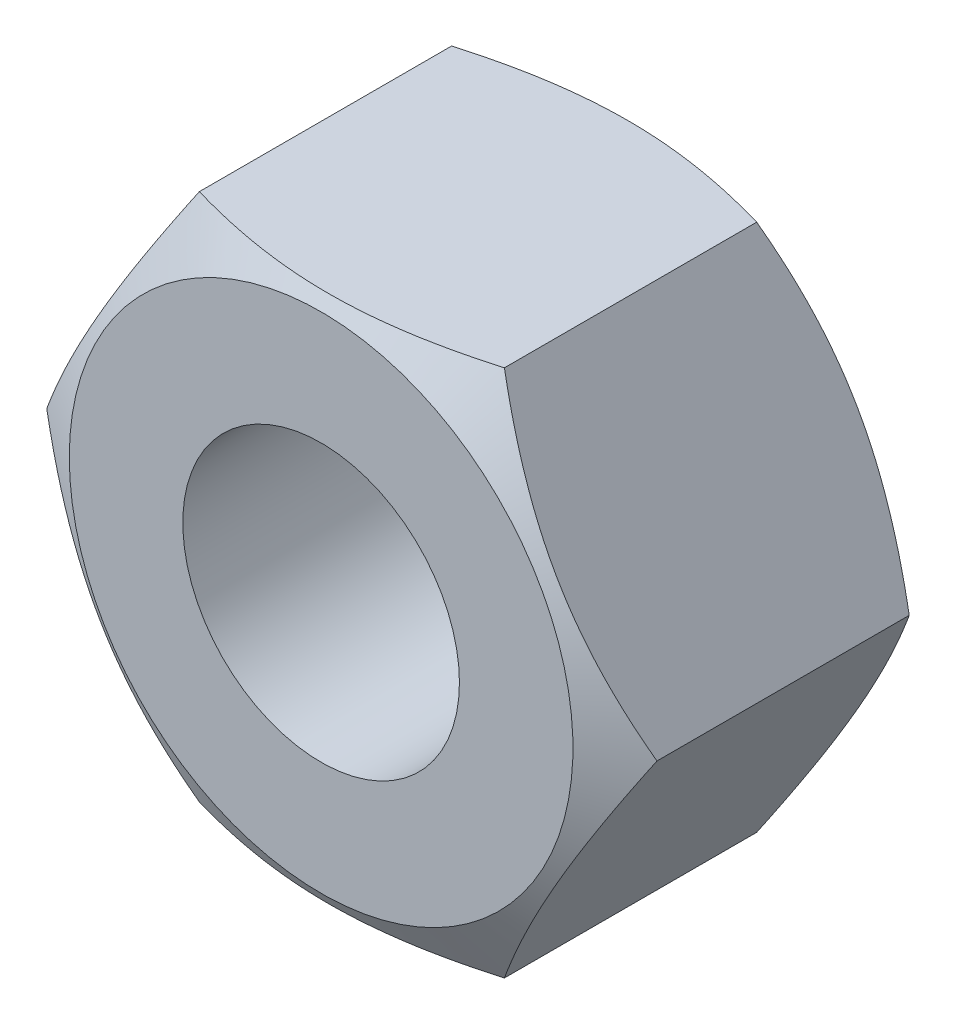
ISO-10303-21;
HEADER;
FILE_DESCRIPTION(('STEP AP214'),'2;1');
FILE_NAME('part.step','',(''),(''),'','','');
FILE_SCHEMA(('AUTOMOTIVE_DESIGN { 1 0 10303 214 1 1 1 1 }'));
ENDSEC;
DATA;
#1=APPLICATION_CONTEXT('core data for automotive mechanical design processes');
#2=APPLICATION_PROTOCOL_DEFINITION('international standard','automotive_design',2000,#1);
#3=PRODUCT_CONTEXT('',#1,'mechanical');
#4=PRODUCT('Part','Part','',(#3));
#5=PRODUCT_RELATED_PRODUCT_CATEGORY('part','',(#4));
#6=PRODUCT_DEFINITION_FORMATION('','',#4);
#7=PRODUCT_DEFINITION_CONTEXT('part definition',#1,'design');
#8=PRODUCT_DEFINITION('design','',#6,#7);
#9=PRODUCT_DEFINITION_SHAPE('','',#8);
#10=(LENGTH_UNIT() NAMED_UNIT(*) SI_UNIT(.MILLI.,.METRE.));
#11=(NAMED_UNIT(*) PLANE_ANGLE_UNIT() SI_UNIT($,.RADIAN.));
#12=(NAMED_UNIT(*) SI_UNIT($,.STERADIAN.) SOLID_ANGLE_UNIT());
#13=UNCERTAINTY_MEASURE_WITH_UNIT(LENGTH_MEASURE(1.E-05),#10,'distance_accuracy_value','');
#14=(GEOMETRIC_REPRESENTATION_CONTEXT(3) GLOBAL_UNCERTAINTY_ASSIGNED_CONTEXT((#13)) GLOBAL_UNIT_ASSIGNED_CONTEXT((#10,
#11,#12)) REPRESENTATION_CONTEXT('',''));
#15=CARTESIAN_POINT('',(0.,0.,0.));
#16=DIRECTION('',(0.,0.,1.));
#17=DIRECTION('',(1.,0.,0.));
#18=AXIS2_PLACEMENT_3D('',#15,#16,#17);
#19=CARTESIAN_POINT('',(-4.618802153517,-8.,-9.5));
#20=DIRECTION('',(0.,-1.,0.));
#21=DIRECTION('',(0.,0.,-1.));
#22=AXIS2_PLACEMENT_3D('',#19,#20,#21);
#23=PLANE('',#22);
#24=CARTESIAN_POINT('',(-12.2197397608942,-8.,-4.03022141401348));
#25=CARTESIAN_POINT('',(-11.868727077628,-8.,-3.86071753558878));
#26=CARTESIAN_POINT('',(-11.5168810873258,-8.,-3.69290788715775));
#27=CARTESIAN_POINT('',(-10.811071762805,-8.,-3.36164590509763));
#28=CARTESIAN_POINT('',(-10.4571080716728,-8.,-3.19819433283699));
#29=CARTESIAN_POINT('',(-9.74468564067489,-8.,-2.87574971001535));
#30=CARTESIAN_POINT('',(-9.38621274986467,-8.,-2.71678781133591));
#31=CARTESIAN_POINT('',(-8.66630957591125,-8.,-2.40573517247906));
#32=CARTESIAN_POINT('',(-8.30487944908738,-8.,-2.25364407184791));
#33=CARTESIAN_POINT('',(-7.57413978369761,-8.,-1.95641301534528));
#34=CARTESIAN_POINT('',(-7.20478765345143,-8.,-1.81137718620378));
#35=CARTESIAN_POINT('',(-6.46171720997474,-8.,-1.53273971576201));
#36=CARTESIAN_POINT('',(-6.08799841532019,-8.,-1.39913934899933));
#37=CARTESIAN_POINT('',(-5.33637311349062,-8.,-1.14698509208066));
#38=CARTESIAN_POINT('',(-4.95847754661189,-8.,-1.02839894848666));
#39=CARTESIAN_POINT('',(-4.19732915983582,-8.,-0.810141761328374));
#40=CARTESIAN_POINT('',(-3.81407808273628,-8.,-0.710464711465893));
#41=CARTESIAN_POINT('',(-3.04188080794891,-8.,-0.534888500997528));
#42=CARTESIAN_POINT('',(-2.65293275749492,-8.,-0.45899726417533));
#43=CARTESIAN_POINT('',(-2.06611409311266,-8.,-0.366816970191737));
#44=CARTESIAN_POINT('',(-1.86991776010488,-8.,-0.339697656224122));
#45=CARTESIAN_POINT('',(-1.47661497416927,-8.,-0.293211843890533));
#46=CARTESIAN_POINT('',(-1.27950860909836,-8.,-0.273844612319937));
#47=CARTESIAN_POINT('',(-0.885886145124463,-8.,-0.243382864344022));
#48=CARTESIAN_POINT('',(-0.689373978742672,-8.,-0.232237734902545));
#49=CARTESIAN_POINT('',(-0.296054597973732,-8.,-0.218278609617564));
#50=CARTESIAN_POINT('',(-0.0992473880544099,-8.,-0.215464488867905));
#51=CARTESIAN_POINT('',(0.294253985501273,-8.,-0.218234288376122));
#52=CARTESIAN_POINT('',(0.490948165353505,-8.,-0.223815876360531));
#53=CARTESIAN_POINT('',(0.883931015832238,-8.,-0.243239131701583));
#54=CARTESIAN_POINT('',(1.08021966403537,-8.,-0.257081244163129));
#55=CARTESIAN_POINT('',(1.55678522848848,-8.,-0.300428868747637));
#56=CARTESIAN_POINT('',(1.83668887397854,-8.,-0.334118737053714));
#57=CARTESIAN_POINT('',(2.39428319697744,-8.,-0.416412622983888));
#58=CARTESIAN_POINT('',(2.67197353587608,-8.,-0.465018879354708));
#59=CARTESIAN_POINT('',(3.50221902369727,-8.,-0.630772157411167));
#60=CARTESIAN_POINT('',(4.05086138070487,-8.,-0.767742256526613));
#61=CARTESIAN_POINT('',(4.87147978211415,-8.,-1.0036664068753));
#62=CARTESIAN_POINT('',(5.14774973161582,-8.,-1.08853026186987));
#63=CARTESIAN_POINT('',(5.69762075848945,-8.,-1.26665801536022));
#64=CARTESIAN_POINT('',(5.9712215938885,-8.,-1.35992266774338));
#65=CARTESIAN_POINT('',(6.51438825331977,-8.,-1.55285819829678));
#66=CARTESIAN_POINT('',(6.7839681451146,-8.,-1.65248987260587));
#67=CARTESIAN_POINT('',(7.32083790463607,-8.,-1.85748379288001));
#68=CARTESIAN_POINT('',(7.58812853108144,-8.,-1.96284404787963));
#69=CARTESIAN_POINT('',(7.85445593980949,-8.,-2.07053145477725));
#70=B_SPLINE_CURVE_WITH_KNOTS('',3,(#24,#25,#26,#27,#28,#29,#30,#31,#32,#33,#34,#35,#36,#37,#38,
#39,#40,#41,#42,#43,#44,#45,#46,#47,#48,#49,#50,#51,#52,#53,#54,#55,#56,#57,#58,#59,#60,#61,#62,
#63,#64,#65,#66,#67,#68,#69),.UNSPECIFIED.,.F.,.F.,(4,2,2,2,2,2,2,2,2,2,2,2,2,2,2,2,2,2,2,2,2,2,
4),(0.,1.16940595501898,2.33901488747737,3.51536959390645,4.69166251493113,5.8819389073909,
7.07234778963652,8.26015441647358,9.44758311348243,10.6354069599858,11.2294630710583,
11.8234629820487,12.4137751626826,13.0040784927678,13.5942178706959,14.1843890501945,
15.0296797373486,15.8750973532219,17.5691968968821,18.4361612735178,19.3032035291794,
20.1653433416826,21.0271854097738),.UNSPECIFIED.);
#71=CARTESIAN_POINT('',(-4.618802153517,-8.,-0.931037530762424));
#72=VERTEX_POINT('',#71);
#73=CARTESIAN_POINT('',(4.61880215351701,-8.,-0.931037530762424));
#74=VERTEX_POINT('',#73);
#75=EDGE_CURVE('E52',#72,#74,#70,.T.);
#76=ORIENTED_EDGE('',*,*,#75,.F.);
#77=DIRECTION('',(0.,0.,1.));
#78=VECTOR('',#77,1.);
#79=CARTESIAN_POINT('',(-4.618802153517,-8.,-9.5));
#80=LINE('',#79,#78);
#81=CARTESIAN_POINT('',(-4.618802153517,-8.,-8.56896246923758));
#82=VERTEX_POINT('',#81);
#83=EDGE_CURVE('E11',#82,#72,#80,.T.);
#84=ORIENTED_EDGE('',*,*,#83,.F.);
#85=CARTESIAN_POINT('',(-12.2197397608942,-8.,-5.46977858598652));
#86=CARTESIAN_POINT('',(-11.868727077628,-8.,-5.63928246441121));
#87=CARTESIAN_POINT('',(-11.5168810873258,-8.,-5.80709211284225));
#88=CARTESIAN_POINT('',(-10.811071762805,-8.,-6.13835409490237));
#89=CARTESIAN_POINT('',(-10.4571080716728,-8.,-6.30180566716301));
#90=CARTESIAN_POINT('',(-9.74468564067489,-8.,-6.62425028998465));
#91=CARTESIAN_POINT('',(-9.38621274986466,-8.,-6.78321218866409));
#92=CARTESIAN_POINT('',(-8.66630957591124,-8.,-7.09426482752095));
#93=CARTESIAN_POINT('',(-8.30487944908737,-8.,-7.2463559281521));
#94=CARTESIAN_POINT('',(-7.5741397836976,-8.,-7.54358698465473));
#95=CARTESIAN_POINT('',(-7.20478765345143,-8.,-7.68862281379622));
#96=CARTESIAN_POINT('',(-6.46171720997473,-8.,-7.96726028423799));
#97=CARTESIAN_POINT('',(-6.08799841532019,-8.,-8.10086065100067));
#98=CARTESIAN_POINT('',(-5.33637311349061,-8.,-8.35301490791934));
#99=CARTESIAN_POINT('',(-4.95847754661189,-8.,-8.47160105151334));
#100=CARTESIAN_POINT('',(-4.19732915983582,-8.,-8.68985823867163));
#101=CARTESIAN_POINT('',(-3.81407808273628,-8.,-8.78953528853411));
#102=CARTESIAN_POINT('',(-3.04188080794891,-8.,-8.96511149900247));
#103=CARTESIAN_POINT('',(-2.65293275749492,-8.,-9.04100273582467));
#104=CARTESIAN_POINT('',(-2.06611409311266,-8.,-9.13318302980826));
#105=CARTESIAN_POINT('',(-1.86991776010488,-8.,-9.16030234377588));
#106=CARTESIAN_POINT('',(-1.47661497416927,-8.,-9.20678815610946));
#107=CARTESIAN_POINT('',(-1.27950860909837,-8.,-9.22615538768006));
#108=CARTESIAN_POINT('',(-0.885886145124465,-8.,-9.25661713565598));
#109=CARTESIAN_POINT('',(-0.689373978742674,-8.,-9.26776226509745));
#110=CARTESIAN_POINT('',(-0.296054597973734,-8.,-9.28172139038243));
#111=CARTESIAN_POINT('',(-0.0992473880544113,-8.,-9.28453551113209));
#112=CARTESIAN_POINT('',(0.294253985501272,-8.,-9.28176571162388));
#113=CARTESIAN_POINT('',(0.490948165353505,-8.,-9.27618412363947));
#114=CARTESIAN_POINT('',(0.883931015832238,-8.,-9.25676086829842));
#115=CARTESIAN_POINT('',(1.08021966403537,-8.,-9.24291875583687));
#116=CARTESIAN_POINT('',(1.55678522848848,-8.,-9.19957113125236));
#117=CARTESIAN_POINT('',(1.83668887397854,-8.,-9.16588126294629));
#118=CARTESIAN_POINT('',(2.39428319697744,-8.,-9.08358737701611));
#119=CARTESIAN_POINT('',(2.67197353587608,-8.,-9.03498112064529));
#120=CARTESIAN_POINT('',(3.50221902369727,-8.,-8.86922784258883));
#121=CARTESIAN_POINT('',(4.05086138070487,-8.,-8.73225774347338));
#122=CARTESIAN_POINT('',(4.87147978211415,-8.,-8.4963335931247));
#123=CARTESIAN_POINT('',(5.14774973161582,-8.,-8.41146973813013));
#124=CARTESIAN_POINT('',(5.69762075848945,-8.,-8.23334198463978));
#125=CARTESIAN_POINT('',(5.97122159388849,-8.,-8.14007733225662));
#126=CARTESIAN_POINT('',(6.51438825331976,-8.,-7.94714180170322));
#127=CARTESIAN_POINT('',(6.78396814511459,-8.,-7.84751012739413));
#128=CARTESIAN_POINT('',(7.32083790463606,-8.,-7.64251620711999));
#129=CARTESIAN_POINT('',(7.58812853108143,-8.,-7.53715595212037));
#130=CARTESIAN_POINT('',(7.85445593980948,-8.,-7.42946854522275));
#131=B_SPLINE_CURVE_WITH_KNOTS('',3,(#85,#86,#87,#88,#89,#90,#91,#92,#93,#94,#95,#96,#97,#98,
#99,#100,#101,#102,#103,#104,#105,#106,#107,#108,#109,#110,#111,#112,#113,#114,#115,#116,#117,
#118,#119,#120,#121,#122,#123,#124,#125,#126,#127,#128,#129,#130),.UNSPECIFIED.,.F.,.F.,(4,2,2,
2,2,2,2,2,2,2,2,2,2,2,2,2,2,2,2,2,2,2,4),(0.,1.16940595501898,2.33901488747738,3.51536959390645,
4.69166251493114,5.8819389073909,7.07234778963652,8.26015441647358,9.44758311348242,
10.6354069599858,11.2294630710583,11.8234629820487,12.4137751626826,13.0040784927678,
13.5942178706959,14.1843890501945,15.0296797373486,15.8750973532219,17.5691968968821,
18.4361612735178,19.3032035291794,20.1653433416826,21.0271854097738),.UNSPECIFIED.);
#132=CARTESIAN_POINT('',(4.618802153517,-8.,-8.56896246923758));
#133=VERTEX_POINT('',#132);
#134=EDGE_CURVE('E131',#133,#82,#131,.F.);
#135=ORIENTED_EDGE('',*,*,#134,.F.);
#136=DIRECTION('',(0.,0.,1.));
#137=VECTOR('',#136,1.);
#138=CARTESIAN_POINT('',(4.61880215351701,-8.,-9.5));
#139=LINE('',#138,#137);
#140=EDGE_CURVE('E39',#133,#74,#139,.T.);
#141=ORIENTED_EDGE('',*,*,#140,.T.);
#142=EDGE_LOOP('',(#76,#84,#135,#141));
#143=FACE_BOUND('',#142,.T.);
#144=ADVANCED_FACE('F35',(#143),#23,.T.);
#145=CARTESIAN_POINT('',(-9.23760430703401,0.,-9.5));
#146=DIRECTION('',(-0.866025403784438,-0.5,0.));
#147=DIRECTION('',(0.5,-0.866025403784439,0.));
#148=AXIS2_PLACEMENT_3D('',#145,#146,#147);
#149=PLANE('',#148);
#150=CARTESIAN_POINT('',(-9.23771977708785,0.00020000000000001,-0.931104198679076));
#151=CARTESIAN_POINT('',(-9.13619343437813,-0.175648783879896,-0.872497064993401));
#152=CARTESIAN_POINT('',(-9.03428856550538,-0.352153194306134,-0.816549751993393));
#153=CARTESIAN_POINT('',(-8.82965122633296,-0.706595462878459,-0.71070735597077));
#154=CARTESIAN_POINT('',(-8.72691841905232,-0.884533904692711,-0.66081488537717));
#155=CARTESIAN_POINT('',(-8.41707512197076,-1.42119823762264,-0.521199148152971));
#156=CARTESIAN_POINT('',(-8.20874154247284,-1.78204258223572,-0.441787521924474));
#157=CARTESIAN_POINT('',(-7.89697436704785,-2.32203917020405,-0.348667997240595));
#158=CARTESIAN_POINT('',(-7.79447216638294,-2.49957818964328,-0.32214093197523));
#159=CARTESIAN_POINT('',(-7.58900421950647,-2.8554591129602,-0.277659525804982));
#160=CARTESIAN_POINT('',(-7.4860385150631,-3.03380094449324,-0.259704427460686));
#161=CARTESIAN_POINT('',(-7.27992981503517,-3.39079168482359,-0.232821999437971));
#162=CARTESIAN_POINT('',(-7.17678715432034,-3.5694400136095,-0.223884424492339));
#163=CARTESIAN_POINT('',(-6.97040655051484,-3.92690170509738,-0.215228654911236));
#164=CARTESIAN_POINT('',(-6.86716861046638,-4.10571506253006,-0.215510175448956));
#165=CARTESIAN_POINT('',(-6.67416139438127,-4.4400133670169,-0.224651376214882));
#166=CARTESIAN_POINT('',(-6.58437849849726,-4.59552190433867,-0.232395955313476));
#167=CARTESIAN_POINT('',(-6.40502298765178,-4.90617476174051,-0.254707485799534));
#168=CARTESIAN_POINT('',(-6.31545038727451,-5.06131905656,-0.269274897084252));
#169=CARTESIAN_POINT('',(-6.04707935721953,-5.52615131589481,-0.322867041473639));
#170=CARTESIAN_POINT('',(-5.86875596743374,-5.83501648718172,-0.371774992615247));
#171=CARTESIAN_POINT('',(-5.51021755801478,-6.4560232287603,-0.494045754180415));
#172=CARTESIAN_POINT('',(-5.3300482973958,-6.76808554211448,-0.5679268713221));
#173=CARTESIAN_POINT('',(-4.97239658367398,-7.38755648169476,-0.735606492201071));
#174=CARTESIAN_POINT('',(-4.79490955046824,-7.69497304089175,-0.829365611800555));
#175=CARTESIAN_POINT('',(-4.61868668346317,-8.0002,-0.931104198679075));
#176=B_SPLINE_CURVE_WITH_KNOTS('',3,(#150,#151,#152,#153,#154,#155,#156,#157,#158,#159,#160,
#161,#162,#163,#164,#165,#166,#167,#168,#169,#170,#171,#172,#173,#174,#175),.UNSPECIFIED.,.F.,
.F.,(4,2,2,2,2,2,2,2,2,2,2,2,4),(0.,0.633973543721351,1.26821965714356,2.53934712434765,
3.15934343977049,3.77928496069784,4.39852133866765,5.01773858515595,5.55680239410248,
6.09590254421147,7.17487077411834,8.27776850154292,9.37850115249054),.UNSPECIFIED.);
#177=CARTESIAN_POINT('',(-9.23760430703401,0.,-0.931037530762424));
#178=VERTEX_POINT('',#177);
#179=EDGE_CURVE('E92',#178,#72,#176,.T.);
#180=ORIENTED_EDGE('',*,*,#179,.F.);
#181=DIRECTION('',(0.,0.,1.));
#182=VECTOR('',#181,1.);
#183=CARTESIAN_POINT('',(-9.23760430703401,0.,-9.5));
#184=LINE('',#183,#182);
#185=CARTESIAN_POINT('',(-9.23760430703401,0.,-8.56896246923758));
#186=VERTEX_POINT('',#185);
#187=EDGE_CURVE('E44',#186,#178,#184,.T.);
#188=ORIENTED_EDGE('',*,*,#187,.F.);
#189=CARTESIAN_POINT('',(-4.61868668346317,-8.0002,-8.56889580132093));
#190=CARTESIAN_POINT('',(-4.72021302617289,-7.8243512161201,-8.6275029350066));
#191=CARTESIAN_POINT('',(-4.82211789504564,-7.64784680569386,-8.68345024800661));
#192=CARTESIAN_POINT('',(-5.02675523421805,-7.29340453712154,-8.78929264402923));
#193=CARTESIAN_POINT('',(-5.12948804149869,-7.11546609530729,-8.83918511462283));
#194=CARTESIAN_POINT('',(-5.43933133858026,-6.57880176237736,-8.97880085184703));
#195=CARTESIAN_POINT('',(-5.64766491807817,-6.21795741776428,-9.05821247807553));
#196=CARTESIAN_POINT('',(-5.95943209350317,-5.67796082979595,-9.15133200275941));
#197=CARTESIAN_POINT('',(-6.06193429416807,-5.50042181035672,-9.17785906802477));
#198=CARTESIAN_POINT('',(-6.26740224104455,-5.1445408870398,-9.22234047419502));
#199=CARTESIAN_POINT('',(-6.37036794548792,-4.96619905550676,-9.24029557253931));
#200=CARTESIAN_POINT('',(-6.57647664551585,-4.60920831517641,-9.26717800056203));
#201=CARTESIAN_POINT('',(-6.67961930623067,-4.4305599863905,-9.27611557550766));
#202=CARTESIAN_POINT('',(-6.88599991003618,-4.07309829490262,-9.28477134508876));
#203=CARTESIAN_POINT('',(-6.98923785008464,-3.89428493746994,-9.28448982455104));
#204=CARTESIAN_POINT('',(-7.18224506616975,-3.5599866329831,-9.27534862378512));
#205=CARTESIAN_POINT('',(-7.27202796205376,-3.40447809566133,-9.26760404468653));
#206=CARTESIAN_POINT('',(-7.45138347289924,-3.09382523825949,-9.24529251420047));
#207=CARTESIAN_POINT('',(-7.5409560732765,-2.93868094344,-9.23072510291575));
#208=CARTESIAN_POINT('',(-7.80932710333148,-2.47384868410519,-9.17713295852636));
#209=CARTESIAN_POINT('',(-7.98765049311728,-2.16498351281828,-9.12822500738475));
#210=CARTESIAN_POINT('',(-8.34618890253624,-1.5439767712397,-9.00595424581958));
#211=CARTESIAN_POINT('',(-8.52635816315521,-1.23191445788553,-8.9320731286779));
#212=CARTESIAN_POINT('',(-8.88400987687704,-0.612443518305243,-8.76439350779893));
#213=CARTESIAN_POINT('',(-9.06149691008277,-0.305026959108251,-8.67063438819944));
#214=CARTESIAN_POINT('',(-9.23771977708785,0.000199999999999209,-8.56889580132092));
#215=B_SPLINE_CURVE_WITH_KNOTS('',3,(#189,#190,#191,#192,#193,#194,#195,#196,#197,#198,#199,
#200,#201,#202,#203,#204,#205,#206,#207,#208,#209,#210,#211,#212,#213,#214),.UNSPECIFIED.,.F.,
.F.,(4,2,2,2,2,2,2,2,2,2,2,2,4),(0.,0.63397354372135,1.26821965714356,2.53934712434765,
3.15934343977049,3.77928496069783,4.39852133866765,5.01773858515594,5.55680239410248,
6.09590254421147,7.17487077411834,8.27776850154292,9.37850115249054),.UNSPECIFIED.);
#216=EDGE_CURVE('E138',#82,#186,#215,.T.);
#217=ORIENTED_EDGE('',*,*,#216,.F.);
#218=ORIENTED_EDGE('',*,*,#83,.T.);
#219=EDGE_LOOP('',(#180,#188,#217,#218));
#220=FACE_BOUND('',#219,.T.);
#221=ADVANCED_FACE('F102',(#220),#149,.T.);
#222=CARTESIAN_POINT('',(-4.618802153517,8.,-9.5));
#223=DIRECTION('',(-0.866025403784439,0.5,0.));
#224=DIRECTION('',(-0.5,-0.866025403784438,0.));
#225=AXIS2_PLACEMENT_3D('',#222,#223,#224);
#226=PLANE('',#225);
#227=CARTESIAN_POINT('',(-4.61868668346317,8.0002,-0.931104198679075));
#228=CARTESIAN_POINT('',(-4.72021302617289,7.8243512161201,-0.8724970649934));
#229=CARTESIAN_POINT('',(-4.82211789504564,7.64784680569387,-0.816549751993393));
#230=CARTESIAN_POINT('',(-5.02675523421805,7.29340453712154,-0.71070735597077));
#231=CARTESIAN_POINT('',(-5.12948804149869,7.11546609530729,-0.66081488537717));
#232=CARTESIAN_POINT('',(-5.43933133858026,6.57880176237736,-0.521199148152971));
#233=CARTESIAN_POINT('',(-5.64766491807817,6.21795741776428,-0.441787521924474));
#234=CARTESIAN_POINT('',(-5.95943209350317,5.67796082979595,-0.348667997240595));
#235=CARTESIAN_POINT('',(-6.06193429416807,5.50042181035672,-0.322140931975231));
#236=CARTESIAN_POINT('',(-6.26740224104454,5.1445408870398,-0.277659525804982));
#237=CARTESIAN_POINT('',(-6.37036794548792,4.96619905550676,-0.259704427460686));
#238=CARTESIAN_POINT('',(-6.57647664551585,4.60920831517641,-0.232821999437971));
#239=CARTESIAN_POINT('',(-6.67961930623067,4.4305599863905,-0.223884424492339));
#240=CARTESIAN_POINT('',(-6.88599991003618,4.07309829490262,-0.215228654911236));
#241=CARTESIAN_POINT('',(-6.98923785008464,3.89428493746994,-0.215510175448956));
#242=CARTESIAN_POINT('',(-7.18224506616975,3.5599866329831,-0.224651376214881));
#243=CARTESIAN_POINT('',(-7.27202796205376,3.40447809566133,-0.232395955313475));
#244=CARTESIAN_POINT('',(-7.45138347289924,3.09382523825949,-0.254707485799533));
#245=CARTESIAN_POINT('',(-7.5409560732765,2.93868094344,-0.269274897084252));
#246=CARTESIAN_POINT('',(-7.80932710333148,2.47384868410519,-0.32286704147364));
#247=CARTESIAN_POINT('',(-7.98765049311728,2.16498351281828,-0.371774992615248));
#248=CARTESIAN_POINT('',(-8.34618890253624,1.5439767712397,-0.494045754180417));
#249=CARTESIAN_POINT('',(-8.52635816315521,1.23191445788553,-0.567926871322102));
#250=CARTESIAN_POINT('',(-8.88400987687704,0.612443518305243,-0.735606492201072));
#251=CARTESIAN_POINT('',(-9.06149691008277,0.305026959108251,-0.829365611800555));
#252=CARTESIAN_POINT('',(-9.23771977708785,-0.000199999999998995,-0.931104198679075));
#253=B_SPLINE_CURVE_WITH_KNOTS('',3,(#227,#228,#229,#230,#231,#232,#233,#234,#235,#236,#237,
#238,#239,#240,#241,#242,#243,#244,#245,#246,#247,#248,#249,#250,#251,#252),.UNSPECIFIED.,.F.,
.F.,(4,2,2,2,2,2,2,2,2,2,2,2,4),(0.,0.633973543721349,1.26821965714356,2.53934712434765,
3.15934343977048,3.77928496069783,4.39852133866765,5.01773858515595,5.55680239410248,
6.09590254421147,7.17487077411834,8.27776850154292,9.37850115249054),.UNSPECIFIED.);
#254=CARTESIAN_POINT('',(-4.61880215351701,8.,-0.931037530762424));
#255=VERTEX_POINT('',#254);
#256=EDGE_CURVE('E88',#255,#178,#253,.T.);
#257=ORIENTED_EDGE('',*,*,#256,.F.);
#258=DIRECTION('',(0.,0.,1.));
#259=VECTOR('',#258,1.);
#260=CARTESIAN_POINT('',(-4.618802153517,8.,-9.5));
#261=LINE('',#260,#259);
#262=CARTESIAN_POINT('',(-4.61880215351701,8.,-8.56896246923758));
#263=VERTEX_POINT('',#262);
#264=EDGE_CURVE('E109',#263,#255,#261,.T.);
#265=ORIENTED_EDGE('',*,*,#264,.F.);
#266=CARTESIAN_POINT('',(-9.23771977708785,-0.000200000000000028,-8.56889580132092));
#267=CARTESIAN_POINT('',(-9.13619343437813,0.175648783879896,-8.6275029350066));
#268=CARTESIAN_POINT('',(-9.03428856550538,0.352153194306134,-8.68345024800661));
#269=CARTESIAN_POINT('',(-8.82965122633296,0.706595462878459,-8.78929264402923));
#270=CARTESIAN_POINT('',(-8.72691841905232,0.884533904692711,-8.83918511462283));
#271=CARTESIAN_POINT('',(-8.41707512197076,1.42119823762264,-8.97880085184703));
#272=CARTESIAN_POINT('',(-8.20874154247284,1.78204258223572,-9.05821247807553));
#273=CARTESIAN_POINT('',(-7.89697436704785,2.32203917020405,-9.15133200275941));
#274=CARTESIAN_POINT('',(-7.79447216638295,2.49957818964328,-9.17785906802477));
#275=CARTESIAN_POINT('',(-7.58900421950647,2.8554591129602,-9.22234047419502));
#276=CARTESIAN_POINT('',(-7.4860385150631,3.03380094449324,-9.24029557253931));
#277=CARTESIAN_POINT('',(-7.27992981503517,3.39079168482359,-9.26717800056203));
#278=CARTESIAN_POINT('',(-7.17678715432035,3.5694400136095,-9.27611557550766));
#279=CARTESIAN_POINT('',(-6.97040655051484,3.92690170509738,-9.28477134508876));
#280=CARTESIAN_POINT('',(-6.86716861046638,4.10571506253006,-9.28448982455104));
#281=CARTESIAN_POINT('',(-6.67416139438127,4.4400133670169,-9.27534862378512));
#282=CARTESIAN_POINT('',(-6.58437849849726,4.59552190433867,-9.26760404468652));
#283=CARTESIAN_POINT('',(-6.40502298765178,4.90617476174051,-9.24529251420047));
#284=CARTESIAN_POINT('',(-6.31545038727452,5.06131905656,-9.23072510291575));
#285=CARTESIAN_POINT('',(-6.04707935721954,5.52615131589481,-9.17713295852636));
#286=CARTESIAN_POINT('',(-5.86875596743374,5.83501648718172,-9.12822500738475));
#287=CARTESIAN_POINT('',(-5.51021755801478,6.4560232287603,-9.00595424581958));
#288=CARTESIAN_POINT('',(-5.3300482973958,6.76808554211448,-8.9320731286779));
#289=CARTESIAN_POINT('',(-4.97239658367398,7.38755648169476,-8.76439350779893));
#290=CARTESIAN_POINT('',(-4.79490955046825,7.69497304089175,-8.67063438819945));
#291=CARTESIAN_POINT('',(-4.61868668346317,8.0002,-8.56889580132092));
#292=B_SPLINE_CURVE_WITH_KNOTS('',3,(#266,#267,#268,#269,#270,#271,#272,#273,#274,#275,#276,
#277,#278,#279,#280,#281,#282,#283,#284,#285,#286,#287,#288,#289,#290,#291),.UNSPECIFIED.,.F.,
.F.,(4,2,2,2,2,2,2,2,2,2,2,2,4),(0.,0.633973543721351,1.26821965714356,2.53934712434765,
3.15934343977049,3.77928496069783,4.39852133866765,5.01773858515595,5.55680239410248,
6.09590254421147,7.17487077411834,8.27776850154292,9.37850115249054),.UNSPECIFIED.);
#293=EDGE_CURVE('E108',#186,#263,#292,.T.);
#294=ORIENTED_EDGE('',*,*,#293,.F.);
#295=ORIENTED_EDGE('',*,*,#187,.T.);
#296=EDGE_LOOP('',(#257,#265,#294,#295));
#297=FACE_BOUND('',#296,.T.);
#298=ADVANCED_FACE('F107',(#297),#226,.T.);
#299=CARTESIAN_POINT('',(4.618802153517,8.,-9.5));
#300=DIRECTION('',(0.,1.,0.));
#301=DIRECTION('',(0.,0.,1.));
#302=AXIS2_PLACEMENT_3D('',#299,#300,#301);
#303=PLANE('',#302);
#304=CARTESIAN_POINT('',(-12.2197397608942,8.,-4.03022141401348));
#305=CARTESIAN_POINT('',(-11.868727077628,8.,-3.86071753558879));
#306=CARTESIAN_POINT('',(-11.5168810873258,8.,-3.69290788715775));
#307=CARTESIAN_POINT('',(-10.811071762805,8.,-3.36164590509763));
#308=CARTESIAN_POINT('',(-10.4571080716728,8.,-3.19819433283699));
#309=CARTESIAN_POINT('',(-9.74468564067489,8.,-2.87574971001535));
#310=CARTESIAN_POINT('',(-9.38621274986467,8.,-2.71678781133591));
#311=CARTESIAN_POINT('',(-8.66630957591124,8.,-2.40573517247906));
#312=CARTESIAN_POINT('',(-8.30487944908738,8.,-2.25364407184791));
#313=CARTESIAN_POINT('',(-7.5741397836976,8.,-1.95641301534528));
#314=CARTESIAN_POINT('',(-7.20478765345143,8.,-1.81137718620378));
#315=CARTESIAN_POINT('',(-6.46171720997474,8.,-1.53273971576201));
#316=CARTESIAN_POINT('',(-6.08799841532019,8.,-1.39913934899933));
#317=CARTESIAN_POINT('',(-5.33637311349061,8.,-1.14698509208066));
#318=CARTESIAN_POINT('',(-4.95847754661189,8.,-1.02839894848666));
#319=CARTESIAN_POINT('',(-4.19732915983582,8.,-0.810141761328375));
#320=CARTESIAN_POINT('',(-3.81407808273628,8.,-0.710464711465894));
#321=CARTESIAN_POINT('',(-3.04188080794891,8.,-0.534888500997528));
#322=CARTESIAN_POINT('',(-2.65293275749492,8.,-0.458997264175331));
#323=CARTESIAN_POINT('',(-2.06611409311266,8.,-0.366816970191738));
#324=CARTESIAN_POINT('',(-1.86991776010488,8.,-0.339697656224124));
#325=CARTESIAN_POINT('',(-1.47661497416927,8.,-0.293211843890535));
#326=CARTESIAN_POINT('',(-1.27950860909836,8.,-0.273844612319939));
#327=CARTESIAN_POINT('',(-0.885886145124464,8.,-0.243382864344023));
#328=CARTESIAN_POINT('',(-0.689373978742674,8.,-0.232237734902546));
#329=CARTESIAN_POINT('',(-0.296054597973733,8.,-0.218278609617565));
#330=CARTESIAN_POINT('',(-0.0992473880544108,8.,-0.215464488867906));
#331=CARTESIAN_POINT('',(0.294253985501273,8.,-0.218234288376123));
#332=CARTESIAN_POINT('',(0.490948165353506,8.,-0.223815876360532));
#333=CARTESIAN_POINT('',(0.883931015832239,8.,-0.243239131701584));
#334=CARTESIAN_POINT('',(1.08021966403537,8.,-0.25708124416313));
#335=CARTESIAN_POINT('',(1.55678522848848,8.,-0.300428868747638));
#336=CARTESIAN_POINT('',(1.83668887397854,8.,-0.334118737053714));
#337=CARTESIAN_POINT('',(2.39428319697744,8.,-0.416412622983888));
#338=CARTESIAN_POINT('',(2.67197353587608,8.,-0.465018879354708));
#339=CARTESIAN_POINT('',(3.50221902369727,8.,-0.630772157411168));
#340=CARTESIAN_POINT('',(4.05086138070487,8.,-0.767742256526614));
#341=CARTESIAN_POINT('',(4.87147978211415,8.,-1.0036664068753));
#342=CARTESIAN_POINT('',(5.14774973161582,8.,-1.08853026186988));
#343=CARTESIAN_POINT('',(5.69762075848946,8.,-1.26665801536022));
#344=CARTESIAN_POINT('',(5.9712215938885,8.,-1.35992266774338));
#345=CARTESIAN_POINT('',(6.51438825331976,8.,-1.55285819829678));
#346=CARTESIAN_POINT('',(6.7839681451146,8.,-1.65248987260587));
#347=CARTESIAN_POINT('',(7.32083790463606,8.,-1.85748379288001));
#348=CARTESIAN_POINT('',(7.58812853108143,8.,-1.96284404787963));
#349=CARTESIAN_POINT('',(7.85445593980948,8.,-2.07053145477725));
#350=B_SPLINE_CURVE_WITH_KNOTS('',3,(#304,#305,#306,#307,#308,#309,#310,#311,#312,#313,#314,
#315,#316,#317,#318,#319,#320,#321,#322,#323,#324,#325,#326,#327,#328,#329,#330,#331,#332,#333,
#334,#335,#336,#337,#338,#339,#340,#341,#342,#343,#344,#345,#346,#347,#348,#349),.UNSPECIFIED.,
.F.,.F.,(4,2,2,2,2,2,2,2,2,2,2,2,2,2,2,2,2,2,2,2,2,2,4),(0.,1.16940595501898,2.33901488747737,
3.51536959390644,4.69166251493114,5.8819389073909,7.07234778963652,8.26015441647358,
9.44758311348242,10.6354069599858,11.2294630710583,11.8234629820487,12.4137751626826,
13.0040784927678,13.5942178706959,14.1843890501945,15.0296797373486,15.8750973532219,
17.5691968968821,18.4361612735178,19.3032035291794,20.1653433416826,21.0271854097738),.UNSPECIFIED.);
#351=CARTESIAN_POINT('',(4.618802153517,8.,-0.931037530762424));
#352=VERTEX_POINT('',#351);
#353=EDGE_CURVE('E94',#352,#255,#350,.F.);
#354=ORIENTED_EDGE('',*,*,#353,.F.);
#355=DIRECTION('',(0.,0.,1.));
#356=VECTOR('',#355,1.);
#357=CARTESIAN_POINT('',(4.618802153517,8.,-9.5));
#358=LINE('',#357,#356);
#359=CARTESIAN_POINT('',(4.618802153517,8.,-8.56896246923758));
#360=VERTEX_POINT('',#359);
#361=EDGE_CURVE('E111',#360,#352,#358,.T.);
#362=ORIENTED_EDGE('',*,*,#361,.F.);
#363=CARTESIAN_POINT('',(-12.2197397608942,8.,-5.46977858598652));
#364=CARTESIAN_POINT('',(-11.868727077628,8.,-5.63928246441121));
#365=CARTESIAN_POINT('',(-11.5168810873258,8.,-5.80709211284225));
#366=CARTESIAN_POINT('',(-10.811071762805,8.,-6.13835409490237));
#367=CARTESIAN_POINT('',(-10.4571080716728,8.,-6.30180566716301));
#368=CARTESIAN_POINT('',(-9.74468564067489,8.,-6.62425028998465));
#369=CARTESIAN_POINT('',(-9.38621274986466,8.,-6.78321218866409));
#370=CARTESIAN_POINT('',(-8.66630957591124,8.,-7.09426482752095));
#371=CARTESIAN_POINT('',(-8.30487944908737,8.,-7.24635592815209));
#372=CARTESIAN_POINT('',(-7.5741397836976,8.,-7.54358698465472));
#373=CARTESIAN_POINT('',(-7.20478765345143,8.,-7.68862281379622));
#374=CARTESIAN_POINT('',(-6.46171720997473,8.,-7.96726028423799));
#375=CARTESIAN_POINT('',(-6.08799841532019,8.,-8.10086065100067));
#376=CARTESIAN_POINT('',(-5.33637311349061,8.,-8.35301490791934));
#377=CARTESIAN_POINT('',(-4.95847754661189,8.,-8.47160105151334));
#378=CARTESIAN_POINT('',(-4.19732915983582,8.,-8.68985823867163));
#379=CARTESIAN_POINT('',(-3.81407808273627,8.,-8.78953528853411));
#380=CARTESIAN_POINT('',(-3.04188080794891,8.,-8.96511149900247));
#381=CARTESIAN_POINT('',(-2.65293275749492,8.,-9.04100273582467));
#382=CARTESIAN_POINT('',(-2.06611409311266,8.,-9.13318302980826));
#383=CARTESIAN_POINT('',(-1.86991776010488,8.,-9.16030234377588));
#384=CARTESIAN_POINT('',(-1.47661497416927,8.,-9.20678815610946));
#385=CARTESIAN_POINT('',(-1.27950860909837,8.,-9.22615538768006));
#386=CARTESIAN_POINT('',(-0.885886145124465,8.,-9.25661713565598));
#387=CARTESIAN_POINT('',(-0.689373978742675,8.,-9.26776226509745));
#388=CARTESIAN_POINT('',(-0.296054597973734,8.,-9.28172139038243));
#389=CARTESIAN_POINT('',(-0.0992473880544112,8.,-9.28453551113209));
#390=CARTESIAN_POINT('',(0.294253985501272,8.,-9.28176571162388));
#391=CARTESIAN_POINT('',(0.490948165353505,8.,-9.27618412363947));
#392=CARTESIAN_POINT('',(0.883931015832238,8.,-9.25676086829841));
#393=CARTESIAN_POINT('',(1.08021966403537,8.,-9.24291875583687));
#394=CARTESIAN_POINT('',(1.55678522848848,8.,-9.19957113125236));
#395=CARTESIAN_POINT('',(1.83668887397854,8.,-9.16588126294629));
#396=CARTESIAN_POINT('',(2.39428319697744,8.,-9.08358737701611));
#397=CARTESIAN_POINT('',(2.67197353587608,8.,-9.03498112064529));
#398=CARTESIAN_POINT('',(3.50221902369727,8.,-8.86922784258883));
#399=CARTESIAN_POINT('',(4.05086138070487,8.,-8.73225774347339));
#400=CARTESIAN_POINT('',(4.87147978211415,8.,-8.4963335931247));
#401=CARTESIAN_POINT('',(5.14774973161582,8.,-8.41146973813012));
#402=CARTESIAN_POINT('',(5.69762075848945,8.,-8.23334198463978));
#403=CARTESIAN_POINT('',(5.9712215938885,8.,-8.14007733225661));
#404=CARTESIAN_POINT('',(6.51438825331976,8.,-7.94714180170322));
#405=CARTESIAN_POINT('',(6.7839681451146,8.,-7.84751012739413));
#406=CARTESIAN_POINT('',(7.32083790463606,8.,-7.64251620711999));
#407=CARTESIAN_POINT('',(7.58812853108143,8.,-7.53715595212037));
#408=CARTESIAN_POINT('',(7.85445593980948,8.,-7.42946854522275));
#409=B_SPLINE_CURVE_WITH_KNOTS('',3,(#363,#364,#365,#366,#367,#368,#369,#370,#371,#372,#373,
#374,#375,#376,#377,#378,#379,#380,#381,#382,#383,#384,#385,#386,#387,#388,#389,#390,#391,#392,
#393,#394,#395,#396,#397,#398,#399,#400,#401,#402,#403,#404,#405,#406,#407,#408),.UNSPECIFIED.,
.F.,.F.,(4,2,2,2,2,2,2,2,2,2,2,2,2,2,2,2,2,2,2,2,2,2,4),(0.,1.16940595501898,2.33901488747737,
3.51536959390645,4.69166251493114,5.8819389073909,7.07234778963652,8.26015441647358,
9.44758311348243,10.6354069599858,11.2294630710583,11.8234629820487,12.4137751626826,
13.0040784927678,13.5942178706959,14.1843890501945,15.0296797373486,15.8750973532219,
17.5691968968821,18.4361612735178,19.3032035291794,20.1653433416826,21.0271854097738),.UNSPECIFIED.);
#410=EDGE_CURVE('E169',#263,#360,#409,.T.);
#411=ORIENTED_EDGE('',*,*,#410,.F.);
#412=ORIENTED_EDGE('',*,*,#264,.T.);
#413=EDGE_LOOP('',(#354,#362,#411,#412));
#414=FACE_BOUND('',#413,.T.);
#415=ADVANCED_FACE('F180',(#414),#303,.T.);
#416=CARTESIAN_POINT('',(9.23760430703401,0.,-9.5));
#417=DIRECTION('',(0.866025403784438,0.5,0.));
#418=DIRECTION('',(-0.5,0.866025403784438,0.));
#419=AXIS2_PLACEMENT_3D('',#416,#417,#418);
#420=PLANE('',#419);
#421=CARTESIAN_POINT('',(9.23771977708785,-0.000199999999998211,-0.931104198679074));
#422=CARTESIAN_POINT('',(9.13619343437812,0.175648783879898,-0.872497064993399));
#423=CARTESIAN_POINT('',(9.03428856550538,0.352153194306136,-0.816549751993392));
#424=CARTESIAN_POINT('',(8.82965122633296,0.70659546287846,-0.710707355970769));
#425=CARTESIAN_POINT('',(8.72691841905232,0.884533904692712,-0.66081488537717));
#426=CARTESIAN_POINT('',(8.41707512197076,1.42119823762264,-0.52119914815297));
#427=CARTESIAN_POINT('',(8.20874154247284,1.78204258223572,-0.441787521924473));
#428=CARTESIAN_POINT('',(7.89697436704785,2.32203917020405,-0.348667997240594));
#429=CARTESIAN_POINT('',(7.79447216638294,2.49957818964328,-0.32214093197523));
#430=CARTESIAN_POINT('',(7.58900421950647,2.8554591129602,-0.277659525804981));
#431=CARTESIAN_POINT('',(7.4860385150631,3.03380094449324,-0.259704427460685));
#432=CARTESIAN_POINT('',(7.27992981503517,3.39079168482359,-0.23282199943797));
#433=CARTESIAN_POINT('',(7.17678715432034,3.5694400136095,-0.223884424492339));
#434=CARTESIAN_POINT('',(6.97040655051484,3.92690170509738,-0.215228654911236));
#435=CARTESIAN_POINT('',(6.86716861046638,4.10571506253006,-0.215510175448955));
#436=CARTESIAN_POINT('',(6.67416139438127,4.4400133670169,-0.22465137621488));
#437=CARTESIAN_POINT('',(6.58437849849726,4.59552190433867,-0.232395955313474));
#438=CARTESIAN_POINT('',(6.40502298765178,4.90617476174051,-0.254707485799532));
#439=CARTESIAN_POINT('',(6.31545038727451,5.06131905656,-0.269274897084251));
#440=CARTESIAN_POINT('',(6.04707935721953,5.52615131589481,-0.32286704147364));
#441=CARTESIAN_POINT('',(5.86875596743374,5.83501648718172,-0.371774992615247));
#442=CARTESIAN_POINT('',(5.51021755801477,6.4560232287603,-0.494045754180415));
#443=CARTESIAN_POINT('',(5.3300482973958,6.76808554211448,-0.5679268713221));
#444=CARTESIAN_POINT('',(4.97239658367398,7.38755648169476,-0.735606492201071));
#445=CARTESIAN_POINT('',(4.79490955046824,7.69497304089175,-0.829365611800554));
#446=CARTESIAN_POINT('',(4.61868668346316,8.0002,-0.931104198679074));
#447=B_SPLINE_CURVE_WITH_KNOTS('',3,(#421,#422,#423,#424,#425,#426,#427,#428,#429,#430,#431,
#432,#433,#434,#435,#436,#437,#438,#439,#440,#441,#442,#443,#444,#445,#446),.UNSPECIFIED.,.F.,
.F.,(4,2,2,2,2,2,2,2,2,2,2,2,4),(0.,0.633973543721349,1.26821965714356,2.53934712434765,
3.15934343977048,3.77928496069783,4.39852133866765,5.01773858515594,5.55680239410248,
6.09590254421147,7.17487077411834,8.27776850154292,9.37850115249054),.UNSPECIFIED.);
#448=CARTESIAN_POINT('',(9.23760430703401,0.,-0.931037530762424));
#449=VERTEX_POINT('',#448);
#450=EDGE_CURVE('E211',#449,#352,#447,.T.);
#451=ORIENTED_EDGE('',*,*,#450,.F.);
#452=DIRECTION('',(0.,0.,1.));
#453=VECTOR('',#452,1.);
#454=CARTESIAN_POINT('',(9.23760430703401,0.,-9.5));
#455=LINE('',#454,#453);
#456=CARTESIAN_POINT('',(9.23760430703401,0.,-8.56896246923758));
#457=VERTEX_POINT('',#456);
#458=EDGE_CURVE('E116',#457,#449,#455,.T.);
#459=ORIENTED_EDGE('',*,*,#458,.F.);
#460=CARTESIAN_POINT('',(4.61868668346316,8.0002,-8.56889580132093));
#461=CARTESIAN_POINT('',(4.72021302617289,7.8243512161201,-8.6275029350066));
#462=CARTESIAN_POINT('',(4.82211789504563,7.64784680569387,-8.68345024800661));
#463=CARTESIAN_POINT('',(5.02675523421805,7.29340453712154,-8.78929264402923));
#464=CARTESIAN_POINT('',(5.12948804149869,7.11546609530729,-8.83918511462283));
#465=CARTESIAN_POINT('',(5.43933133858026,6.57880176237736,-8.97880085184703));
#466=CARTESIAN_POINT('',(5.64766491807817,6.21795741776428,-9.05821247807553));
#467=CARTESIAN_POINT('',(5.95943209350316,5.67796082979595,-9.15133200275941));
#468=CARTESIAN_POINT('',(6.06193429416807,5.50042181035672,-9.17785906802477));
#469=CARTESIAN_POINT('',(6.26740224104454,5.1445408870398,-9.22234047419502));
#470=CARTESIAN_POINT('',(6.37036794548791,4.96619905550676,-9.24029557253932));
#471=CARTESIAN_POINT('',(6.57647664551585,4.60920831517641,-9.26717800056203));
#472=CARTESIAN_POINT('',(6.67961930623067,4.4305599863905,-9.27611557550766));
#473=CARTESIAN_POINT('',(6.88599991003618,4.07309829490262,-9.28477134508877));
#474=CARTESIAN_POINT('',(6.98923785008463,3.89428493746994,-9.28448982455104));
#475=CARTESIAN_POINT('',(7.18224506616975,3.5599866329831,-9.27534862378512));
#476=CARTESIAN_POINT('',(7.27202796205375,3.40447809566133,-9.26760404468653));
#477=CARTESIAN_POINT('',(7.45138347289923,3.09382523825949,-9.24529251420047));
#478=CARTESIAN_POINT('',(7.5409560732765,2.93868094344001,-9.23072510291575));
#479=CARTESIAN_POINT('',(7.80932710333148,2.47384868410519,-9.17713295852636));
#480=CARTESIAN_POINT('',(7.98765049311727,2.16498351281829,-9.12822500738475));
#481=CARTESIAN_POINT('',(8.34618890253624,1.54397677123971,-9.00595424581958));
#482=CARTESIAN_POINT('',(8.52635816315521,1.23191445788553,-8.9320731286779));
#483=CARTESIAN_POINT('',(8.88400987687704,0.612443518305243,-8.76439350779893));
#484=CARTESIAN_POINT('',(9.06149691008277,0.305026959108251,-8.67063438819945));
#485=CARTESIAN_POINT('',(9.23771977708785,-0.000199999999998812,-8.56889580132093));
#486=B_SPLINE_CURVE_WITH_KNOTS('',3,(#460,#461,#462,#463,#464,#465,#466,#467,#468,#469,#470,
#471,#472,#473,#474,#475,#476,#477,#478,#479,#480,#481,#482,#483,#484,#485),.UNSPECIFIED.,.F.,
.F.,(4,2,2,2,2,2,2,2,2,2,2,2,4),(0.,0.633973543721349,1.26821965714356,2.53934712434765,
3.15934343977049,3.77928496069783,4.39852133866765,5.01773858515595,5.55680239410248,
6.09590254421147,7.17487077411834,8.27776850154292,9.37850115249054),.UNSPECIFIED.);
#487=EDGE_CURVE('E60',#360,#457,#486,.T.);
#488=ORIENTED_EDGE('',*,*,#487,.F.);
#489=ORIENTED_EDGE('',*,*,#361,.T.);
#490=EDGE_LOOP('',(#451,#459,#488,#489));
#491=FACE_BOUND('',#490,.T.);
#492=ADVANCED_FACE('F210',(#491),#420,.T.);
#493=CARTESIAN_POINT('',(4.61880215351701,-8.,-9.5));
#494=DIRECTION('',(0.866025403784439,-0.5,0.));
#495=DIRECTION('',(0.5,0.866025403784439,0.));
#496=AXIS2_PLACEMENT_3D('',#493,#494,#495);
#497=PLANE('',#496);
#498=CARTESIAN_POINT('',(4.61868668346317,-8.0002,-0.931104198679075));
#499=CARTESIAN_POINT('',(4.72021302617289,-7.8243512161201,-0.8724970649934));
#500=CARTESIAN_POINT('',(4.82211789504564,-7.64784680569386,-0.816549751993393));
#501=CARTESIAN_POINT('',(5.02675523421805,-7.29340453712154,-0.71070735597077));
#502=CARTESIAN_POINT('',(5.12948804149869,-7.11546609530729,-0.66081488537717));
#503=CARTESIAN_POINT('',(5.43933133858026,-6.57880176237736,-0.521199148152971));
#504=CARTESIAN_POINT('',(5.64766491807818,-6.21795741776428,-0.441787521924473));
#505=CARTESIAN_POINT('',(5.95943209350317,-5.67796082979595,-0.348667997240594));
#506=CARTESIAN_POINT('',(6.06193429416807,-5.50042181035672,-0.32214093197523));
#507=CARTESIAN_POINT('',(6.26740224104455,-5.1445408870398,-0.277659525804981));
#508=CARTESIAN_POINT('',(6.37036794548792,-4.96619905550676,-0.259704427460686));
#509=CARTESIAN_POINT('',(6.57647664551585,-4.60920831517641,-0.232821999437971));
#510=CARTESIAN_POINT('',(6.67961930623067,-4.4305599863905,-0.223884424492339));
#511=CARTESIAN_POINT('',(6.88599991003618,-4.07309829490262,-0.215228654911236));
#512=CARTESIAN_POINT('',(6.98923785008464,-3.89428493746994,-0.215510175448955));
#513=CARTESIAN_POINT('',(7.18224506616975,-3.5599866329831,-0.224651376214881));
#514=CARTESIAN_POINT('',(7.27202796205376,-3.40447809566133,-0.232395955313475));
#515=CARTESIAN_POINT('',(7.45138347289924,-3.09382523825949,-0.254707485799534));
#516=CARTESIAN_POINT('',(7.5409560732765,-2.93868094344,-0.269274897084252));
#517=CARTESIAN_POINT('',(7.80932710333148,-2.47384868410518,-0.322867041473639));
#518=CARTESIAN_POINT('',(7.98765049311728,-2.16498351281828,-0.371774992615247));
#519=CARTESIAN_POINT('',(8.34618890253624,-1.5439767712397,-0.494045754180415));
#520=CARTESIAN_POINT('',(8.52635816315521,-1.23191445788552,-0.567926871322101));
#521=CARTESIAN_POINT('',(8.88400987687704,-0.612443518305242,-0.735606492201072));
#522=CARTESIAN_POINT('',(9.06149691008277,-0.305026959108249,-0.829365611800555));
#523=CARTESIAN_POINT('',(9.23771977708785,0.000200000000001173,-0.931104198679074));
#524=B_SPLINE_CURVE_WITH_KNOTS('',3,(#498,#499,#500,#501,#502,#503,#504,#505,#506,#507,#508,
#509,#510,#511,#512,#513,#514,#515,#516,#517,#518,#519,#520,#521,#522,#523),.UNSPECIFIED.,.F.,
.F.,(4,2,2,2,2,2,2,2,2,2,2,2,4),(0.,0.633973543721349,1.26821965714356,2.53934712434765,
3.15934343977049,3.77928496069783,4.39852133866765,5.01773858515595,5.55680239410248,
6.09590254421147,7.17487077411834,8.27776850154292,9.37850115249054),.UNSPECIFIED.);
#525=EDGE_CURVE('E212',#74,#449,#524,.T.);
#526=ORIENTED_EDGE('',*,*,#525,.F.);
#527=ORIENTED_EDGE('',*,*,#140,.F.);
#528=CARTESIAN_POINT('',(9.23771977708785,0.000200000000001828,-8.56889580132093));
#529=CARTESIAN_POINT('',(9.13619343437812,-0.175648783879895,-8.6275029350066));
#530=CARTESIAN_POINT('',(9.03428856550538,-0.352153194306133,-8.68345024800661));
#531=CARTESIAN_POINT('',(8.82965122633296,-0.706595462878458,-8.78929264402923));
#532=CARTESIAN_POINT('',(8.72691841905232,-0.88453390469271,-8.83918511462283));
#533=CARTESIAN_POINT('',(8.41707512197076,-1.42119823762264,-8.97880085184703));
#534=CARTESIAN_POINT('',(8.20874154247284,-1.78204258223572,-9.05821247807553));
#535=CARTESIAN_POINT('',(7.89697436704785,-2.32203917020405,-9.15133200275941));
#536=CARTESIAN_POINT('',(7.79447216638294,-2.49957818964328,-9.17785906802477));
#537=CARTESIAN_POINT('',(7.58900421950647,-2.8554591129602,-9.22234047419502));
#538=CARTESIAN_POINT('',(7.4860385150631,-3.03380094449324,-9.24029557253931));
#539=CARTESIAN_POINT('',(7.27992981503517,-3.39079168482359,-9.26717800056203));
#540=CARTESIAN_POINT('',(7.17678715432035,-3.5694400136095,-9.27611557550766));
#541=CARTESIAN_POINT('',(6.97040655051484,-3.92690170509738,-9.28477134508876));
#542=CARTESIAN_POINT('',(6.86716861046638,-4.10571506253006,-9.28448982455104));
#543=CARTESIAN_POINT('',(6.67416139438127,-4.4400133670169,-9.27534862378512));
#544=CARTESIAN_POINT('',(6.58437849849726,-4.59552190433867,-9.26760404468653));
#545=CARTESIAN_POINT('',(6.40502298765178,-4.90617476174051,-9.24529251420047));
#546=CARTESIAN_POINT('',(6.31545038727452,-5.06131905655999,-9.23072510291575));
#547=CARTESIAN_POINT('',(6.04707935721954,-5.52615131589481,-9.17713295852636));
#548=CARTESIAN_POINT('',(5.86875596743374,-5.83501648718171,-9.12822500738475));
#549=CARTESIAN_POINT('',(5.51021755801478,-6.4560232287603,-9.00595424581958));
#550=CARTESIAN_POINT('',(5.33004829739581,-6.76808554211448,-8.9320731286779));
#551=CARTESIAN_POINT('',(4.97239658367398,-7.38755648169476,-8.76439350779893));
#552=CARTESIAN_POINT('',(4.79490955046825,-7.69497304089175,-8.67063438819945));
#553=CARTESIAN_POINT('',(4.61868668346317,-8.0002,-8.56889580132093));
#554=B_SPLINE_CURVE_WITH_KNOTS('',3,(#528,#529,#530,#531,#532,#533,#534,#535,#536,#537,#538,
#539,#540,#541,#542,#543,#544,#545,#546,#547,#548,#549,#550,#551,#552,#553),.UNSPECIFIED.,.F.,
.F.,(4,2,2,2,2,2,2,2,2,2,2,2,4),(0.,0.63397354372135,1.26821965714356,2.53934712434765,
3.15934343977048,3.77928496069783,4.39852133866765,5.01773858515595,5.55680239410248,
6.09590254421147,7.17487077411834,8.27776850154292,9.37850115249054),.UNSPECIFIED.);
#555=EDGE_CURVE('E155',#457,#133,#554,.T.);
#556=ORIENTED_EDGE('',*,*,#555,.F.);
#557=ORIENTED_EDGE('',*,*,#458,.T.);
#558=EDGE_LOOP('',(#526,#527,#556,#557));
#559=FACE_BOUND('',#558,.T.);
#560=ADVANCED_FACE('F224',(#559),#497,.T.);
#561=CARTESIAN_POINT('',(4.61880215351701,-8.,-9.5));
#562=DIRECTION('',(0.,0.,1.));
#563=DIRECTION('',(1.,0.,0.));
#564=AXIS2_PLACEMENT_3D('',#561,#562,#563);
#565=PLANE('',#564);
#566=CARTESIAN_POINT('',(0.,0.,-9.5));
#567=DIRECTION('',(0.,0.,-1.));
#568=DIRECTION('',(-1.,0.,0.));
#569=AXIS2_PLACEMENT_3D('',#566,#567,#568);
#570=CIRCLE('',#569,7.625);
#571=CARTESIAN_POINT('',(-7.625,0.,-9.5));
#572=VERTEX_POINT('',#571);
#573=EDGE_CURVE('E200',#572,#572,#570,.T.);
#574=ORIENTED_EDGE('',*,*,#573,.T.);
#575=EDGE_LOOP('',(#574));
#576=FACE_BOUND('',#575,.T.);
#577=CARTESIAN_POINT('',(0.,0.,-9.5));
#578=DIRECTION('',(0.,0.,1.));
#579=DIRECTION('',(1.,0.,0.));
#580=AXIS2_PLACEMENT_3D('',#577,#578,#579);
#581=CIRCLE('',#580,4.188);
#582=CARTESIAN_POINT('',(4.188,0.,-9.5));
#583=VERTEX_POINT('',#582);
#584=EDGE_CURVE('E121',#583,#583,#581,.T.);
#585=ORIENTED_EDGE('',*,*,#584,.T.);
#586=EDGE_LOOP('',(#585));
#587=FACE_BOUND('',#586,.T.);
#588=ADVANCED_FACE('F228',(#576,#587),#565,.F.);
#589=CARTESIAN_POINT('',(4.61880215351701,-8.,0.));
#590=DIRECTION('',(0.,0.,1.));
#591=DIRECTION('',(1.,0.,0.));
#592=AXIS2_PLACEMENT_3D('',#589,#590,#591);
#593=PLANE('',#592);
#594=CARTESIAN_POINT('',(0.,0.,0.));
#595=DIRECTION('',(0.,0.,-1.));
#596=DIRECTION('',(-1.,0.,0.));
#597=AXIS2_PLACEMENT_3D('',#594,#595,#596);
#598=CIRCLE('',#597,7.625);
#599=CARTESIAN_POINT('',(-7.625,0.,0.));
#600=VERTEX_POINT('',#599);
#601=EDGE_CURVE('E213',#600,#600,#598,.T.);
#602=ORIENTED_EDGE('',*,*,#601,.F.);
#603=EDGE_LOOP('',(#602));
#604=FACE_BOUND('',#603,.T.);
#605=CARTESIAN_POINT('',(0.,0.,0.));
#606=DIRECTION('',(0.,0.,1.));
#607=DIRECTION('',(1.,0.,0.));
#608=AXIS2_PLACEMENT_3D('',#605,#606,#607);
#609=CIRCLE('',#608,4.188);
#610=CARTESIAN_POINT('',(4.188,0.,0.));
#611=VERTEX_POINT('',#610);
#612=EDGE_CURVE('E126',#611,#611,#609,.T.);
#613=ORIENTED_EDGE('',*,*,#612,.F.);
#614=EDGE_LOOP('',(#613));
#615=FACE_BOUND('',#614,.T.);
#616=ADVANCED_FACE('F233',(#604,#615),#593,.T.);
#617=CARTESIAN_POINT('',(0.,0.,-9.5));
#618=DIRECTION('',(0.,0.,1.));
#619=DIRECTION('',(1.,0.,0.));
#620=AXIS2_PLACEMENT_3D('',#617,#618,#619);
#621=CYLINDRICAL_SURFACE('',#620,4.188);
#622=ORIENTED_EDGE('',*,*,#584,.F.);
#623=EDGE_LOOP('',(#622));
#624=FACE_BOUND('',#623,.T.);
#625=ORIENTED_EDGE('',*,*,#612,.T.);
#626=EDGE_LOOP('',(#625));
#627=FACE_BOUND('',#626,.T.);
#628=ADVANCED_FACE('F149',(#624,#627),#621,.F.);
#629=CARTESIAN_POINT('',(0.,0.,-8.56896246923758));
#630=DIRECTION('',(0.,0.,1.));
#631=DIRECTION('',(1.,0.,0.));
#632=AXIS2_PLACEMENT_3D('',#629,#630,#631);
#633=CONICAL_SURFACE('',#632,9.23760430703401,1.0471975511966);
#634=ORIENTED_EDGE('',*,*,#134,.T.);
#635=ORIENTED_EDGE('',*,*,#216,.T.);
#636=ORIENTED_EDGE('',*,*,#293,.T.);
#637=ORIENTED_EDGE('',*,*,#410,.T.);
#638=ORIENTED_EDGE('',*,*,#487,.T.);
#639=ORIENTED_EDGE('',*,*,#555,.T.);
#640=EDGE_LOOP('',(#634,#635,#636,#637,#638,#639));
#641=FACE_BOUND('',#640,.T.);
#642=ORIENTED_EDGE('',*,*,#573,.F.);
#643=EDGE_LOOP('',(#642));
#644=FACE_BOUND('',#643,.T.);
#645=ADVANCED_FACE('F144',(#641,#644),#633,.T.);
#646=CARTESIAN_POINT('',(0.,0.,0.));
#647=DIRECTION('',(0.,0.,-1.));
#648=DIRECTION('',(-1.,0.,0.));
#649=AXIS2_PLACEMENT_3D('',#646,#647,#648);
#650=CONICAL_SURFACE('',#649,7.625,1.0471975511966);
#651=ORIENTED_EDGE('',*,*,#75,.T.);
#652=ORIENTED_EDGE('',*,*,#525,.T.);
#653=ORIENTED_EDGE('',*,*,#450,.T.);
#654=ORIENTED_EDGE('',*,*,#353,.T.);
#655=ORIENTED_EDGE('',*,*,#256,.T.);
#656=ORIENTED_EDGE('',*,*,#179,.T.);
#657=EDGE_LOOP('',(#651,#652,#653,#654,#655,#656));
#658=FACE_BOUND('',#657,.T.);
#659=ORIENTED_EDGE('',*,*,#601,.T.);
#660=EDGE_LOOP('',(#659));
#661=FACE_BOUND('',#660,.T.);
#662=ADVANCED_FACE('F90',(#658,#661),#650,.T.);
#663=CLOSED_SHELL('',(#144,#221,#298,#415,#492,#560,#588,#616,#628,#645,#662));
#664=MANIFOLD_SOLID_BREP('B2',#663);
#665=ADVANCED_BREP_SHAPE_REPRESENTATION('',(#18,#664),#14);
#666=SHAPE_DEFINITION_REPRESENTATION(#9,#665);
ENDSEC;
END-ISO-10303-21;
